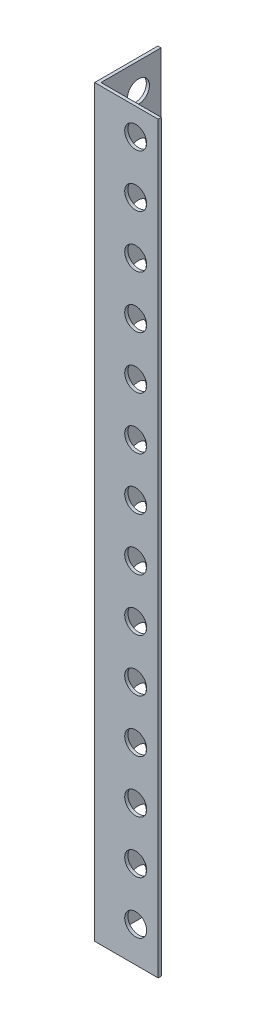
ISO-10303-21;
HEADER;
FILE_DESCRIPTION(('STEP AP214'),'2;1');
FILE_NAME('part.step','',(''),(''),'','','');
FILE_SCHEMA(('AUTOMOTIVE_DESIGN { 1 0 10303 214 1 1 1 1 }'));
ENDSEC;
DATA;
#1=APPLICATION_CONTEXT('core data for automotive mechanical design processes');
#2=APPLICATION_PROTOCOL_DEFINITION('international standard','automotive_design',2000,#1);
#3=PRODUCT_CONTEXT('',#1,'mechanical');
#4=PRODUCT('Part','Part','',(#3));
#5=PRODUCT_RELATED_PRODUCT_CATEGORY('part','',(#4));
#6=PRODUCT_DEFINITION_FORMATION('','',#4);
#7=PRODUCT_DEFINITION_CONTEXT('part definition',#1,'design');
#8=PRODUCT_DEFINITION('design','',#6,#7);
#9=PRODUCT_DEFINITION_SHAPE('','',#8);
#10=(LENGTH_UNIT() NAMED_UNIT(*) SI_UNIT(.MILLI.,.METRE.));
#11=(NAMED_UNIT(*) PLANE_ANGLE_UNIT() SI_UNIT($,.RADIAN.));
#12=(NAMED_UNIT(*) SI_UNIT($,.STERADIAN.) SOLID_ANGLE_UNIT());
#13=UNCERTAINTY_MEASURE_WITH_UNIT(LENGTH_MEASURE(1.E-05),#10,'distance_accuracy_value','');
#14=(GEOMETRIC_REPRESENTATION_CONTEXT(3) GLOBAL_UNCERTAINTY_ASSIGNED_CONTEXT((#13)) GLOBAL_UNIT_ASSIGNED_CONTEXT((#10,
#11,#12)) REPRESENTATION_CONTEXT('',''));
#15=CARTESIAN_POINT('',(0.,0.,0.));
#16=DIRECTION('',(0.,0.,1.));
#17=DIRECTION('',(1.,0.,0.));
#18=AXIS2_PLACEMENT_3D('',#15,#16,#17);
#19=CARTESIAN_POINT('',(0.,363.031,-30.861));
#20=DIRECTION('',(1.,0.,0.));
#21=DIRECTION('',(0.,0.,-1.));
#22=AXIS2_PLACEMENT_3D('',#19,#20,#21);
#23=PLANE('',#22);
#24=CARTESIAN_POINT('',(0.,324.431,-19.861));
#25=DIRECTION('',(-1.,0.,0.));
#26=DIRECTION('',(0.,0.,1.));
#27=AXIS2_PLACEMENT_3D('',#24,#25,#26);
#28=CIRCLE('',#27,5.35);
#29=CARTESIAN_POINT('',(0.,324.431,-14.511));
#30=VERTEX_POINT('',#29);
#31=EDGE_CURVE('E149',#30,#30,#28,.T.);
#32=ORIENTED_EDGE('',*,*,#31,.F.);
#33=EDGE_LOOP('',(#32));
#34=FACE_BOUND('',#33,.T.);
#35=CARTESIAN_POINT('',(0.,298.831,-19.861));
#36=DIRECTION('',(-1.,0.,0.));
#37=DIRECTION('',(0.,0.,1.));
#38=AXIS2_PLACEMENT_3D('',#35,#36,#37);
#39=CIRCLE('',#38,5.35);
#40=CARTESIAN_POINT('',(0.,298.831,-14.511));
#41=VERTEX_POINT('',#40);
#42=EDGE_CURVE('E274',#41,#41,#39,.T.);
#43=ORIENTED_EDGE('',*,*,#42,.F.);
#44=EDGE_LOOP('',(#43));
#45=FACE_BOUND('',#44,.T.);
#46=CARTESIAN_POINT('',(0.,273.231,-19.861));
#47=DIRECTION('',(-1.,0.,0.));
#48=DIRECTION('',(0.,0.,1.));
#49=AXIS2_PLACEMENT_3D('',#46,#47,#48);
#50=CIRCLE('',#49,5.35);
#51=CARTESIAN_POINT('',(0.,273.231,-14.511));
#52=VERTEX_POINT('',#51);
#53=EDGE_CURVE('E278',#52,#52,#50,.T.);
#54=ORIENTED_EDGE('',*,*,#53,.F.);
#55=EDGE_LOOP('',(#54));
#56=FACE_BOUND('',#55,.T.);
#57=CARTESIAN_POINT('',(0.,247.631,-19.861));
#58=DIRECTION('',(-1.,0.,0.));
#59=DIRECTION('',(0.,0.,1.));
#60=AXIS2_PLACEMENT_3D('',#57,#58,#59);
#61=CIRCLE('',#60,5.35);
#62=CARTESIAN_POINT('',(0.,247.631,-14.511));
#63=VERTEX_POINT('',#62);
#64=EDGE_CURVE('E282',#63,#63,#61,.T.);
#65=ORIENTED_EDGE('',*,*,#64,.F.);
#66=EDGE_LOOP('',(#65));
#67=FACE_BOUND('',#66,.T.);
#68=CARTESIAN_POINT('',(0.,222.031,-19.861));
#69=DIRECTION('',(-1.,0.,0.));
#70=DIRECTION('',(0.,0.,1.));
#71=AXIS2_PLACEMENT_3D('',#68,#69,#70);
#72=CIRCLE('',#71,5.35);
#73=CARTESIAN_POINT('',(0.,222.031,-14.511));
#74=VERTEX_POINT('',#73);
#75=EDGE_CURVE('E286',#74,#74,#72,.T.);
#76=ORIENTED_EDGE('',*,*,#75,.F.);
#77=EDGE_LOOP('',(#76));
#78=FACE_BOUND('',#77,.T.);
#79=CARTESIAN_POINT('',(0.,196.431,-19.861));
#80=DIRECTION('',(-1.,0.,0.));
#81=DIRECTION('',(0.,0.,1.));
#82=AXIS2_PLACEMENT_3D('',#79,#80,#81);
#83=CIRCLE('',#82,5.35);
#84=CARTESIAN_POINT('',(0.,196.431,-14.511));
#85=VERTEX_POINT('',#84);
#86=EDGE_CURVE('E290',#85,#85,#83,.T.);
#87=ORIENTED_EDGE('',*,*,#86,.F.);
#88=EDGE_LOOP('',(#87));
#89=FACE_BOUND('',#88,.T.);
#90=CARTESIAN_POINT('',(0.,170.831,-19.861));
#91=DIRECTION('',(-1.,0.,0.));
#92=DIRECTION('',(0.,0.,1.));
#93=AXIS2_PLACEMENT_3D('',#90,#91,#92);
#94=CIRCLE('',#93,5.35);
#95=CARTESIAN_POINT('',(0.,170.831,-14.511));
#96=VERTEX_POINT('',#95);
#97=EDGE_CURVE('E294',#96,#96,#94,.T.);
#98=ORIENTED_EDGE('',*,*,#97,.F.);
#99=EDGE_LOOP('',(#98));
#100=FACE_BOUND('',#99,.T.);
#101=CARTESIAN_POINT('',(0.,145.231,-19.861));
#102=DIRECTION('',(-1.,0.,0.));
#103=DIRECTION('',(0.,0.,1.));
#104=AXIS2_PLACEMENT_3D('',#101,#102,#103);
#105=CIRCLE('',#104,5.35);
#106=CARTESIAN_POINT('',(0.,145.231,-14.511));
#107=VERTEX_POINT('',#106);
#108=EDGE_CURVE('E298',#107,#107,#105,.T.);
#109=ORIENTED_EDGE('',*,*,#108,.F.);
#110=EDGE_LOOP('',(#109));
#111=FACE_BOUND('',#110,.T.);
#112=CARTESIAN_POINT('',(0.,119.631,-19.861));
#113=DIRECTION('',(-1.,0.,0.));
#114=DIRECTION('',(0.,0.,1.));
#115=AXIS2_PLACEMENT_3D('',#112,#113,#114);
#116=CIRCLE('',#115,5.35);
#117=CARTESIAN_POINT('',(0.,119.631,-14.511));
#118=VERTEX_POINT('',#117);
#119=EDGE_CURVE('E302',#118,#118,#116,.T.);
#120=ORIENTED_EDGE('',*,*,#119,.F.);
#121=EDGE_LOOP('',(#120));
#122=FACE_BOUND('',#121,.T.);
#123=CARTESIAN_POINT('',(0.,94.031,-19.861));
#124=DIRECTION('',(-1.,0.,0.));
#125=DIRECTION('',(0.,0.,1.));
#126=AXIS2_PLACEMENT_3D('',#123,#124,#125);
#127=CIRCLE('',#126,5.35);
#128=CARTESIAN_POINT('',(0.,94.031,-14.511));
#129=VERTEX_POINT('',#128);
#130=EDGE_CURVE('E306',#129,#129,#127,.T.);
#131=ORIENTED_EDGE('',*,*,#130,.F.);
#132=EDGE_LOOP('',(#131));
#133=FACE_BOUND('',#132,.T.);
#134=CARTESIAN_POINT('',(0.,68.431,-19.861));
#135=DIRECTION('',(-1.,0.,0.));
#136=DIRECTION('',(0.,0.,1.));
#137=AXIS2_PLACEMENT_3D('',#134,#135,#136);
#138=CIRCLE('',#137,5.35);
#139=CARTESIAN_POINT('',(0.,68.431,-14.511));
#140=VERTEX_POINT('',#139);
#141=EDGE_CURVE('E232',#140,#140,#138,.T.);
#142=ORIENTED_EDGE('',*,*,#141,.F.);
#143=EDGE_LOOP('',(#142));
#144=FACE_BOUND('',#143,.T.);
#145=CARTESIAN_POINT('',(0.,42.831,-19.861));
#146=DIRECTION('',(-1.,0.,0.));
#147=DIRECTION('',(0.,0.,1.));
#148=AXIS2_PLACEMENT_3D('',#145,#146,#147);
#149=CIRCLE('',#148,5.35);
#150=CARTESIAN_POINT('',(0.,42.831,-14.511));
#151=VERTEX_POINT('',#150);
#152=EDGE_CURVE('E227',#151,#151,#149,.T.);
#153=ORIENTED_EDGE('',*,*,#152,.F.);
#154=EDGE_LOOP('',(#153));
#155=FACE_BOUND('',#154,.T.);
#156=CARTESIAN_POINT('',(0.,17.2309999999999,-19.861));
#157=DIRECTION('',(-1.,0.,0.));
#158=DIRECTION('',(0.,0.,1.));
#159=AXIS2_PLACEMENT_3D('',#156,#157,#158);
#160=CIRCLE('',#159,5.35);
#161=CARTESIAN_POINT('',(0.,17.2309999999999,-14.511));
#162=VERTEX_POINT('',#161);
#163=EDGE_CURVE('E223',#162,#162,#160,.T.);
#164=ORIENTED_EDGE('',*,*,#163,.F.);
#165=EDGE_LOOP('',(#164));
#166=FACE_BOUND('',#165,.T.);
#167=CARTESIAN_POINT('',(0.,350.031,-19.861));
#168=DIRECTION('',(-1.,0.,0.));
#169=DIRECTION('',(0.,0.,1.));
#170=AXIS2_PLACEMENT_3D('',#167,#168,#169);
#171=CIRCLE('',#170,5.35);
#172=CARTESIAN_POINT('',(0.,350.031,-14.511));
#173=VERTEX_POINT('',#172);
#174=EDGE_CURVE('E140',#173,#173,#171,.T.);
#175=ORIENTED_EDGE('',*,*,#174,.F.);
#176=EDGE_LOOP('',(#175));
#177=FACE_BOUND('',#176,.T.);
#178=DIRECTION('',(0.,0.,1.));
#179=VECTOR('',#178,1.);
#180=CARTESIAN_POINT('',(0.,0.,-30.861));
#181=LINE('',#180,#179);
#182=CARTESIAN_POINT('',(0.,0.,-30.861));
#183=VERTEX_POINT('',#182);
#184=CARTESIAN_POINT('',(0.,0.,0.));
#185=VERTEX_POINT('',#184);
#186=EDGE_CURVE('E121',#183,#185,#181,.T.);
#187=ORIENTED_EDGE('',*,*,#186,.T.);
#188=DIRECTION('',(0.,-1.,0.));
#189=VECTOR('',#188,1.);
#190=CARTESIAN_POINT('',(0.,363.031,0.));
#191=LINE('',#190,#189);
#192=CARTESIAN_POINT('',(0.,363.031,0.));
#193=VERTEX_POINT('',#192);
#194=EDGE_CURVE('E11',#193,#185,#191,.T.);
#195=ORIENTED_EDGE('',*,*,#194,.F.);
#196=DIRECTION('',(0.,0.,1.));
#197=VECTOR('',#196,1.);
#198=CARTESIAN_POINT('',(0.,363.031,-30.861));
#199=LINE('',#198,#197);
#200=CARTESIAN_POINT('',(0.,363.031,-30.861));
#201=VERTEX_POINT('',#200);
#202=EDGE_CURVE('E132',#201,#193,#199,.T.);
#203=ORIENTED_EDGE('',*,*,#202,.F.);
#204=DIRECTION('',(0.,-1.,0.));
#205=VECTOR('',#204,1.);
#206=CARTESIAN_POINT('',(0.,363.031,-30.861));
#207=LINE('',#206,#205);
#208=EDGE_CURVE('E117',#201,#183,#207,.T.);
#209=ORIENTED_EDGE('',*,*,#208,.T.);
#210=EDGE_LOOP('',(#187,#195,#203,#209));
#211=FACE_BOUND('',#210,.T.);
#212=ADVANCED_FACE('F35',(#34,#45,#56,#67,#78,#89,#100,#111,#122,#133,#144,#155,#166,#177,#211),
#23,.F.);
#213=CARTESIAN_POINT('',(0.,363.031,0.));
#214=DIRECTION('',(0.,0.,-1.));
#215=DIRECTION('',(-1.,0.,0.));
#216=AXIS2_PLACEMENT_3D('',#213,#214,#215);
#217=PLANE('',#216);
#218=CARTESIAN_POINT('',(20.0261,324.431,0.));
#219=DIRECTION('',(0.,0.,1.));
#220=DIRECTION('',(1.,0.,0.));
#221=AXIS2_PLACEMENT_3D('',#218,#219,#220);
#222=CIRCLE('',#221,5.35);
#223=CARTESIAN_POINT('',(25.3761,324.431,0.));
#224=VERTEX_POINT('',#223);
#225=EDGE_CURVE('E189',#224,#224,#222,.T.);
#226=ORIENTED_EDGE('',*,*,#225,.F.);
#227=EDGE_LOOP('',(#226));
#228=FACE_BOUND('',#227,.T.);
#229=CARTESIAN_POINT('',(20.0261,298.831,0.));
#230=DIRECTION('',(0.,0.,1.));
#231=DIRECTION('',(1.,0.,0.));
#232=AXIS2_PLACEMENT_3D('',#229,#230,#231);
#233=CIRCLE('',#232,5.35);
#234=CARTESIAN_POINT('',(25.3761,298.831,0.));
#235=VERTEX_POINT('',#234);
#236=EDGE_CURVE('E436',#235,#235,#233,.T.);
#237=ORIENTED_EDGE('',*,*,#236,.F.);
#238=EDGE_LOOP('',(#237));
#239=FACE_BOUND('',#238,.T.);
#240=CARTESIAN_POINT('',(20.0261,273.231,0.));
#241=DIRECTION('',(0.,0.,1.));
#242=DIRECTION('',(1.,0.,0.));
#243=AXIS2_PLACEMENT_3D('',#240,#241,#242);
#244=CIRCLE('',#243,5.35);
#245=CARTESIAN_POINT('',(25.3761,273.231,0.));
#246=VERTEX_POINT('',#245);
#247=EDGE_CURVE('E439',#246,#246,#244,.T.);
#248=ORIENTED_EDGE('',*,*,#247,.F.);
#249=EDGE_LOOP('',(#248));
#250=FACE_BOUND('',#249,.T.);
#251=CARTESIAN_POINT('',(20.0261,247.631,0.));
#252=DIRECTION('',(0.,0.,1.));
#253=DIRECTION('',(1.,0.,0.));
#254=AXIS2_PLACEMENT_3D('',#251,#252,#253);
#255=CIRCLE('',#254,5.35);
#256=CARTESIAN_POINT('',(25.3761,247.631,0.));
#257=VERTEX_POINT('',#256);
#258=EDGE_CURVE('E444',#257,#257,#255,.T.);
#259=ORIENTED_EDGE('',*,*,#258,.F.);
#260=EDGE_LOOP('',(#259));
#261=FACE_BOUND('',#260,.T.);
#262=CARTESIAN_POINT('',(20.0261,222.031,0.));
#263=DIRECTION('',(0.,0.,1.));
#264=DIRECTION('',(1.,0.,0.));
#265=AXIS2_PLACEMENT_3D('',#262,#263,#264);
#266=CIRCLE('',#265,5.35);
#267=CARTESIAN_POINT('',(25.3761,222.031,0.));
#268=VERTEX_POINT('',#267);
#269=EDGE_CURVE('E447',#268,#268,#266,.T.);
#270=ORIENTED_EDGE('',*,*,#269,.F.);
#271=EDGE_LOOP('',(#270));
#272=FACE_BOUND('',#271,.T.);
#273=CARTESIAN_POINT('',(20.0261,196.431,0.));
#274=DIRECTION('',(0.,0.,1.));
#275=DIRECTION('',(1.,0.,0.));
#276=AXIS2_PLACEMENT_3D('',#273,#274,#275);
#277=CIRCLE('',#276,5.35);
#278=CARTESIAN_POINT('',(25.3761,196.431,0.));
#279=VERTEX_POINT('',#278);
#280=EDGE_CURVE('E450',#279,#279,#277,.T.);
#281=ORIENTED_EDGE('',*,*,#280,.F.);
#282=EDGE_LOOP('',(#281));
#283=FACE_BOUND('',#282,.T.);
#284=CARTESIAN_POINT('',(20.0261,170.831,0.));
#285=DIRECTION('',(0.,0.,1.));
#286=DIRECTION('',(1.,0.,0.));
#287=AXIS2_PLACEMENT_3D('',#284,#285,#286);
#288=CIRCLE('',#287,5.35);
#289=CARTESIAN_POINT('',(25.3761,170.831,0.));
#290=VERTEX_POINT('',#289);
#291=EDGE_CURVE('E453',#290,#290,#288,.T.);
#292=ORIENTED_EDGE('',*,*,#291,.F.);
#293=EDGE_LOOP('',(#292));
#294=FACE_BOUND('',#293,.T.);
#295=CARTESIAN_POINT('',(20.0261,145.231,0.));
#296=DIRECTION('',(0.,0.,1.));
#297=DIRECTION('',(1.,0.,0.));
#298=AXIS2_PLACEMENT_3D('',#295,#296,#297);
#299=CIRCLE('',#298,5.35);
#300=CARTESIAN_POINT('',(25.3761,145.231,0.));
#301=VERTEX_POINT('',#300);
#302=EDGE_CURVE('E456',#301,#301,#299,.T.);
#303=ORIENTED_EDGE('',*,*,#302,.F.);
#304=EDGE_LOOP('',(#303));
#305=FACE_BOUND('',#304,.T.);
#306=CARTESIAN_POINT('',(20.0261,119.631,0.));
#307=DIRECTION('',(0.,0.,1.));
#308=DIRECTION('',(1.,0.,0.));
#309=AXIS2_PLACEMENT_3D('',#306,#307,#308);
#310=CIRCLE('',#309,5.35);
#311=CARTESIAN_POINT('',(25.3761,119.631,0.));
#312=VERTEX_POINT('',#311);
#313=EDGE_CURVE('E459',#312,#312,#310,.T.);
#314=ORIENTED_EDGE('',*,*,#313,.F.);
#315=EDGE_LOOP('',(#314));
#316=FACE_BOUND('',#315,.T.);
#317=CARTESIAN_POINT('',(20.0261,94.031,0.));
#318=DIRECTION('',(0.,0.,1.));
#319=DIRECTION('',(1.,0.,0.));
#320=AXIS2_PLACEMENT_3D('',#317,#318,#319);
#321=CIRCLE('',#320,5.35);
#322=CARTESIAN_POINT('',(25.3761,94.031,0.));
#323=VERTEX_POINT('',#322);
#324=EDGE_CURVE('E462',#323,#323,#321,.T.);
#325=ORIENTED_EDGE('',*,*,#324,.F.);
#326=EDGE_LOOP('',(#325));
#327=FACE_BOUND('',#326,.T.);
#328=CARTESIAN_POINT('',(20.0261,68.431,0.));
#329=DIRECTION('',(0.,0.,1.));
#330=DIRECTION('',(1.,0.,0.));
#331=AXIS2_PLACEMENT_3D('',#328,#329,#330);
#332=CIRCLE('',#331,5.35);
#333=CARTESIAN_POINT('',(25.3761,68.431,0.));
#334=VERTEX_POINT('',#333);
#335=EDGE_CURVE('E465',#334,#334,#332,.T.);
#336=ORIENTED_EDGE('',*,*,#335,.F.);
#337=EDGE_LOOP('',(#336));
#338=FACE_BOUND('',#337,.T.);
#339=CARTESIAN_POINT('',(20.0261,42.831,0.));
#340=DIRECTION('',(0.,0.,1.));
#341=DIRECTION('',(1.,0.,0.));
#342=AXIS2_PLACEMENT_3D('',#339,#340,#341);
#343=CIRCLE('',#342,5.35);
#344=CARTESIAN_POINT('',(25.3761,42.831,0.));
#345=VERTEX_POINT('',#344);
#346=EDGE_CURVE('E468',#345,#345,#343,.T.);
#347=ORIENTED_EDGE('',*,*,#346,.F.);
#348=EDGE_LOOP('',(#347));
#349=FACE_BOUND('',#348,.T.);
#350=CARTESIAN_POINT('',(20.0261,17.2309999999999,0.));
#351=DIRECTION('',(0.,0.,1.));
#352=DIRECTION('',(1.,0.,0.));
#353=AXIS2_PLACEMENT_3D('',#350,#351,#352);
#354=CIRCLE('',#353,5.35);
#355=CARTESIAN_POINT('',(25.3761,17.2309999999999,0.));
#356=VERTEX_POINT('',#355);
#357=EDGE_CURVE('E471',#356,#356,#354,.T.);
#358=ORIENTED_EDGE('',*,*,#357,.F.);
#359=EDGE_LOOP('',(#358));
#360=FACE_BOUND('',#359,.T.);
#361=CARTESIAN_POINT('',(20.0261,350.031,0.));
#362=DIRECTION('',(0.,0.,1.));
#363=DIRECTION('',(1.,0.,0.));
#364=AXIS2_PLACEMENT_3D('',#361,#362,#363);
#365=CIRCLE('',#364,5.35);
#366=CARTESIAN_POINT('',(25.3761,350.031,0.));
#367=VERTEX_POINT('',#366);
#368=EDGE_CURVE('E144',#367,#367,#365,.T.);
#369=ORIENTED_EDGE('',*,*,#368,.F.);
#370=EDGE_LOOP('',(#369));
#371=FACE_BOUND('',#370,.T.);
#372=DIRECTION('',(1.,0.,0.));
#373=VECTOR('',#372,1.);
#374=CARTESIAN_POINT('',(0.,0.,0.));
#375=LINE('',#374,#373);
#376=CARTESIAN_POINT('',(31.0261,0.,0.));
#377=VERTEX_POINT('',#376);
#378=EDGE_CURVE('E124',#185,#377,#375,.T.);
#379=ORIENTED_EDGE('',*,*,#378,.T.);
#380=DIRECTION('',(0.,-1.,0.));
#381=VECTOR('',#380,1.);
#382=CARTESIAN_POINT('',(31.0261,363.031,0.));
#383=LINE('',#382,#381);
#384=CARTESIAN_POINT('',(31.0261,363.031,0.));
#385=VERTEX_POINT('',#384);
#386=EDGE_CURVE('E44',#385,#377,#383,.T.);
#387=ORIENTED_EDGE('',*,*,#386,.F.);
#388=DIRECTION('',(1.,0.,0.));
#389=VECTOR('',#388,1.);
#390=CARTESIAN_POINT('',(0.,363.031,0.));
#391=LINE('',#390,#389);
#392=EDGE_CURVE('E90',#193,#385,#391,.T.);
#393=ORIENTED_EDGE('',*,*,#392,.F.);
#394=ORIENTED_EDGE('',*,*,#194,.T.);
#395=EDGE_LOOP('',(#379,#387,#393,#394));
#396=FACE_BOUND('',#395,.T.);
#397=ADVANCED_FACE('F243',(#228,#239,#250,#261,#272,#283,#294,#305,#316,#327,#338,#349,#360,
#371,#396),#217,.F.);
#398=CARTESIAN_POINT('',(31.0261,363.031,0.));
#399=DIRECTION('',(-1.,0.,0.));
#400=DIRECTION('',(0.,0.,1.));
#401=AXIS2_PLACEMENT_3D('',#398,#399,#400);
#402=PLANE('',#401);
#403=DIRECTION('',(0.,0.,-1.));
#404=VECTOR('',#403,1.);
#405=CARTESIAN_POINT('',(31.0261,0.,0.));
#406=LINE('',#405,#404);
#407=CARTESIAN_POINT('',(31.0261,0.,-1.54));
#408=VERTEX_POINT('',#407);
#409=EDGE_CURVE('E127',#377,#408,#406,.T.);
#410=ORIENTED_EDGE('',*,*,#409,.T.);
#411=DIRECTION('',(0.,-1.,0.));
#412=VECTOR('',#411,1.);
#413=CARTESIAN_POINT('',(31.0261,363.031,-1.54));
#414=LINE('',#413,#412);
#415=CARTESIAN_POINT('',(31.0261,363.031,-1.54));
#416=VERTEX_POINT('',#415);
#417=EDGE_CURVE('E112',#416,#408,#414,.T.);
#418=ORIENTED_EDGE('',*,*,#417,.F.);
#419=DIRECTION('',(0.,0.,-1.));
#420=VECTOR('',#419,1.);
#421=CARTESIAN_POINT('',(31.0261,363.031,0.));
#422=LINE('',#421,#420);
#423=EDGE_CURVE('E103',#385,#416,#422,.T.);
#424=ORIENTED_EDGE('',*,*,#423,.F.);
#425=ORIENTED_EDGE('',*,*,#386,.T.);
#426=EDGE_LOOP('',(#410,#418,#424,#425));
#427=FACE_BOUND('',#426,.T.);
#428=ADVANCED_FACE('F246',(#427),#402,.F.);
#429=CARTESIAN_POINT('',(31.0261,363.031,-1.54));
#430=DIRECTION('',(0.,0.,1.));
#431=DIRECTION('',(1.,0.,0.));
#432=AXIS2_PLACEMENT_3D('',#429,#430,#431);
#433=PLANE('',#432);
#434=CARTESIAN_POINT('',(20.0261,324.431,-1.54));
#435=DIRECTION('',(0.,0.,1.));
#436=DIRECTION('',(1.,0.,0.));
#437=AXIS2_PLACEMENT_3D('',#434,#435,#436);
#438=CIRCLE('',#437,5.35);
#439=CARTESIAN_POINT('',(25.3761,324.431,-1.54));
#440=VERTEX_POINT('',#439);
#441=EDGE_CURVE('E38',#440,#440,#438,.T.);
#442=ORIENTED_EDGE('',*,*,#441,.T.);
#443=EDGE_LOOP('',(#442));
#444=FACE_BOUND('',#443,.T.);
#445=CARTESIAN_POINT('',(20.0261,298.831,-1.54));
#446=DIRECTION('',(0.,0.,1.));
#447=DIRECTION('',(1.,0.,0.));
#448=AXIS2_PLACEMENT_3D('',#445,#446,#447);
#449=CIRCLE('',#448,5.35);
#450=CARTESIAN_POINT('',(25.3761,298.831,-1.54));
#451=VERTEX_POINT('',#450);
#452=EDGE_CURVE('E218',#451,#451,#449,.T.);
#453=ORIENTED_EDGE('',*,*,#452,.T.);
#454=EDGE_LOOP('',(#453));
#455=FACE_BOUND('',#454,.T.);
#456=CARTESIAN_POINT('',(20.0261,273.231,-1.54));
#457=DIRECTION('',(0.,0.,1.));
#458=DIRECTION('',(1.,0.,0.));
#459=AXIS2_PLACEMENT_3D('',#456,#457,#458);
#460=CIRCLE('',#459,5.35);
#461=CARTESIAN_POINT('',(25.3761,273.231,-1.54));
#462=VERTEX_POINT('',#461);
#463=EDGE_CURVE('E216',#462,#462,#460,.T.);
#464=ORIENTED_EDGE('',*,*,#463,.T.);
#465=EDGE_LOOP('',(#464));
#466=FACE_BOUND('',#465,.T.);
#467=CARTESIAN_POINT('',(20.0261,247.631,-1.54));
#468=DIRECTION('',(0.,0.,1.));
#469=DIRECTION('',(1.,0.,0.));
#470=AXIS2_PLACEMENT_3D('',#467,#468,#469);
#471=CIRCLE('',#470,5.35);
#472=CARTESIAN_POINT('',(25.3761,247.631,-1.54));
#473=VERTEX_POINT('',#472);
#474=EDGE_CURVE('E213',#473,#473,#471,.T.);
#475=ORIENTED_EDGE('',*,*,#474,.T.);
#476=EDGE_LOOP('',(#475));
#477=FACE_BOUND('',#476,.T.);
#478=CARTESIAN_POINT('',(20.0261,222.031,-1.54));
#479=DIRECTION('',(0.,0.,1.));
#480=DIRECTION('',(1.,0.,0.));
#481=AXIS2_PLACEMENT_3D('',#478,#479,#480);
#482=CIRCLE('',#481,5.35);
#483=CARTESIAN_POINT('',(25.3761,222.031,-1.54));
#484=VERTEX_POINT('',#483);
#485=EDGE_CURVE('E210',#484,#484,#482,.T.);
#486=ORIENTED_EDGE('',*,*,#485,.T.);
#487=EDGE_LOOP('',(#486));
#488=FACE_BOUND('',#487,.T.);
#489=CARTESIAN_POINT('',(20.0261,196.431,-1.54));
#490=DIRECTION('',(0.,0.,1.));
#491=DIRECTION('',(1.,0.,0.));
#492=AXIS2_PLACEMENT_3D('',#489,#490,#491);
#493=CIRCLE('',#492,5.35);
#494=CARTESIAN_POINT('',(25.3761,196.431,-1.54));
#495=VERTEX_POINT('',#494);
#496=EDGE_CURVE('E207',#495,#495,#493,.T.);
#497=ORIENTED_EDGE('',*,*,#496,.T.);
#498=EDGE_LOOP('',(#497));
#499=FACE_BOUND('',#498,.T.);
#500=CARTESIAN_POINT('',(20.0261,170.831,-1.54));
#501=DIRECTION('',(0.,0.,1.));
#502=DIRECTION('',(1.,0.,0.));
#503=AXIS2_PLACEMENT_3D('',#500,#501,#502);
#504=CIRCLE('',#503,5.35);
#505=CARTESIAN_POINT('',(25.3761,170.831,-1.54));
#506=VERTEX_POINT('',#505);
#507=EDGE_CURVE('E204',#506,#506,#504,.T.);
#508=ORIENTED_EDGE('',*,*,#507,.T.);
#509=EDGE_LOOP('',(#508));
#510=FACE_BOUND('',#509,.T.);
#511=CARTESIAN_POINT('',(20.0261,145.231,-1.54));
#512=DIRECTION('',(0.,0.,1.));
#513=DIRECTION('',(1.,0.,0.));
#514=AXIS2_PLACEMENT_3D('',#511,#512,#513);
#515=CIRCLE('',#514,5.35);
#516=CARTESIAN_POINT('',(25.3761,145.231,-1.54));
#517=VERTEX_POINT('',#516);
#518=EDGE_CURVE('E201',#517,#517,#515,.T.);
#519=ORIENTED_EDGE('',*,*,#518,.T.);
#520=EDGE_LOOP('',(#519));
#521=FACE_BOUND('',#520,.T.);
#522=CARTESIAN_POINT('',(20.0261,119.631,-1.54));
#523=DIRECTION('',(0.,0.,1.));
#524=DIRECTION('',(1.,0.,0.));
#525=AXIS2_PLACEMENT_3D('',#522,#523,#524);
#526=CIRCLE('',#525,5.35);
#527=CARTESIAN_POINT('',(25.3761,119.631,-1.54));
#528=VERTEX_POINT('',#527);
#529=EDGE_CURVE('E198',#528,#528,#526,.T.);
#530=ORIENTED_EDGE('',*,*,#529,.T.);
#531=EDGE_LOOP('',(#530));
#532=FACE_BOUND('',#531,.T.);
#533=CARTESIAN_POINT('',(20.0261,94.031,-1.54));
#534=DIRECTION('',(0.,0.,1.));
#535=DIRECTION('',(1.,0.,0.));
#536=AXIS2_PLACEMENT_3D('',#533,#534,#535);
#537=CIRCLE('',#536,5.35);
#538=CARTESIAN_POINT('',(25.3761,94.031,-1.54));
#539=VERTEX_POINT('',#538);
#540=EDGE_CURVE('E195',#539,#539,#537,.T.);
#541=ORIENTED_EDGE('',*,*,#540,.T.);
#542=EDGE_LOOP('',(#541));
#543=FACE_BOUND('',#542,.T.);
#544=CARTESIAN_POINT('',(20.0261,68.431,-1.54));
#545=DIRECTION('',(0.,0.,1.));
#546=DIRECTION('',(1.,0.,0.));
#547=AXIS2_PLACEMENT_3D('',#544,#545,#546);
#548=CIRCLE('',#547,5.35);
#549=CARTESIAN_POINT('',(25.3761,68.431,-1.54));
#550=VERTEX_POINT('',#549);
#551=EDGE_CURVE('E192',#550,#550,#548,.T.);
#552=ORIENTED_EDGE('',*,*,#551,.T.);
#553=EDGE_LOOP('',(#552));
#554=FACE_BOUND('',#553,.T.);
#555=CARTESIAN_POINT('',(20.0261,42.831,-1.54));
#556=DIRECTION('',(0.,0.,1.));
#557=DIRECTION('',(1.,0.,0.));
#558=AXIS2_PLACEMENT_3D('',#555,#556,#557);
#559=CIRCLE('',#558,5.35);
#560=CARTESIAN_POINT('',(25.3761,42.831,-1.54));
#561=VERTEX_POINT('',#560);
#562=EDGE_CURVE('E188',#561,#561,#559,.T.);
#563=ORIENTED_EDGE('',*,*,#562,.T.);
#564=EDGE_LOOP('',(#563));
#565=FACE_BOUND('',#564,.T.);
#566=CARTESIAN_POINT('',(20.0261,17.2309999999999,-1.54));
#567=DIRECTION('',(0.,0.,1.));
#568=DIRECTION('',(1.,0.,0.));
#569=AXIS2_PLACEMENT_3D('',#566,#567,#568);
#570=CIRCLE('',#569,5.35);
#571=CARTESIAN_POINT('',(25.3761,17.2309999999999,-1.54));
#572=VERTEX_POINT('',#571);
#573=EDGE_CURVE('E185',#572,#572,#570,.T.);
#574=ORIENTED_EDGE('',*,*,#573,.T.);
#575=EDGE_LOOP('',(#574));
#576=FACE_BOUND('',#575,.T.);
#577=CARTESIAN_POINT('',(20.0261,350.031,-1.54));
#578=DIRECTION('',(0.,0.,1.));
#579=DIRECTION('',(1.,0.,0.));
#580=AXIS2_PLACEMENT_3D('',#577,#578,#579);
#581=CIRCLE('',#580,5.35);
#582=CARTESIAN_POINT('',(25.3761,350.031,-1.54));
#583=VERTEX_POINT('',#582);
#584=EDGE_CURVE('E141',#583,#583,#581,.T.);
#585=ORIENTED_EDGE('',*,*,#584,.T.);
#586=EDGE_LOOP('',(#585));
#587=FACE_BOUND('',#586,.T.);
#588=DIRECTION('',(-1.,0.,0.));
#589=VECTOR('',#588,1.);
#590=CARTESIAN_POINT('',(31.0261,0.,-1.54));
#591=LINE('',#590,#589);
#592=CARTESIAN_POINT('',(1.54,0.,-1.54));
#593=VERTEX_POINT('',#592);
#594=EDGE_CURVE('E111',#408,#593,#591,.T.);
#595=ORIENTED_EDGE('',*,*,#594,.T.);
#596=DIRECTION('',(0.,-1.,0.));
#597=VECTOR('',#596,1.);
#598=CARTESIAN_POINT('',(1.54,363.031,-1.54));
#599=LINE('',#598,#597);
#600=CARTESIAN_POINT('',(1.54,363.031,-1.54));
#601=VERTEX_POINT('',#600);
#602=EDGE_CURVE('E108',#601,#593,#599,.T.);
#603=ORIENTED_EDGE('',*,*,#602,.F.);
#604=DIRECTION('',(-1.,0.,0.));
#605=VECTOR('',#604,1.);
#606=CARTESIAN_POINT('',(31.0261,363.031,-1.54));
#607=LINE('',#606,#605);
#608=EDGE_CURVE('E97',#416,#601,#607,.T.);
#609=ORIENTED_EDGE('',*,*,#608,.F.);
#610=ORIENTED_EDGE('',*,*,#417,.T.);
#611=EDGE_LOOP('',(#595,#603,#609,#610));
#612=FACE_BOUND('',#611,.T.);
#613=ADVANCED_FACE('F109',(#444,#455,#466,#477,#488,#499,#510,#521,#532,#543,#554,#565,#576,
#587,#612),#433,.F.);
#614=CARTESIAN_POINT('',(1.54,363.031,-1.54));
#615=DIRECTION('',(-1.,0.,0.));
#616=DIRECTION('',(0.,0.,1.));
#617=AXIS2_PLACEMENT_3D('',#614,#615,#616);
#618=PLANE('',#617);
#619=CARTESIAN_POINT('',(1.54,324.431,-19.861));
#620=DIRECTION('',(-1.,0.,0.));
#621=DIRECTION('',(0.,0.,1.));
#622=AXIS2_PLACEMENT_3D('',#619,#620,#621);
#623=CIRCLE('',#622,5.35);
#624=CARTESIAN_POINT('',(1.54,324.431,-14.511));
#625=VERTEX_POINT('',#624);
#626=EDGE_CURVE('E182',#625,#625,#623,.T.);
#627=ORIENTED_EDGE('',*,*,#626,.T.);
#628=EDGE_LOOP('',(#627));
#629=FACE_BOUND('',#628,.T.);
#630=CARTESIAN_POINT('',(1.54,298.831,-19.861));
#631=DIRECTION('',(-1.,0.,0.));
#632=DIRECTION('',(0.,0.,1.));
#633=AXIS2_PLACEMENT_3D('',#630,#631,#632);
#634=CIRCLE('',#633,5.35);
#635=CARTESIAN_POINT('',(1.54,298.831,-14.511));
#636=VERTEX_POINT('',#635);
#637=EDGE_CURVE('E179',#636,#636,#634,.T.);
#638=ORIENTED_EDGE('',*,*,#637,.T.);
#639=EDGE_LOOP('',(#638));
#640=FACE_BOUND('',#639,.T.);
#641=CARTESIAN_POINT('',(1.54,273.231,-19.861));
#642=DIRECTION('',(-1.,0.,0.));
#643=DIRECTION('',(0.,0.,1.));
#644=AXIS2_PLACEMENT_3D('',#641,#642,#643);
#645=CIRCLE('',#644,5.35);
#646=CARTESIAN_POINT('',(1.54,273.231,-14.511));
#647=VERTEX_POINT('',#646);
#648=EDGE_CURVE('E176',#647,#647,#645,.T.);
#649=ORIENTED_EDGE('',*,*,#648,.T.);
#650=EDGE_LOOP('',(#649));
#651=FACE_BOUND('',#650,.T.);
#652=CARTESIAN_POINT('',(1.54,247.631,-19.861));
#653=DIRECTION('',(-1.,0.,0.));
#654=DIRECTION('',(0.,0.,1.));
#655=AXIS2_PLACEMENT_3D('',#652,#653,#654);
#656=CIRCLE('',#655,5.35);
#657=CARTESIAN_POINT('',(1.54,247.631,-14.511));
#658=VERTEX_POINT('',#657);
#659=EDGE_CURVE('E173',#658,#658,#656,.T.);
#660=ORIENTED_EDGE('',*,*,#659,.T.);
#661=EDGE_LOOP('',(#660));
#662=FACE_BOUND('',#661,.T.);
#663=CARTESIAN_POINT('',(1.54,222.031,-19.861));
#664=DIRECTION('',(-1.,0.,0.));
#665=DIRECTION('',(0.,0.,1.));
#666=AXIS2_PLACEMENT_3D('',#663,#664,#665);
#667=CIRCLE('',#666,5.35);
#668=CARTESIAN_POINT('',(1.54,222.031,-14.511));
#669=VERTEX_POINT('',#668);
#670=EDGE_CURVE('E170',#669,#669,#667,.T.);
#671=ORIENTED_EDGE('',*,*,#670,.T.);
#672=EDGE_LOOP('',(#671));
#673=FACE_BOUND('',#672,.T.);
#674=CARTESIAN_POINT('',(1.54,196.431,-19.861));
#675=DIRECTION('',(-1.,0.,0.));
#676=DIRECTION('',(0.,0.,1.));
#677=AXIS2_PLACEMENT_3D('',#674,#675,#676);
#678=CIRCLE('',#677,5.35);
#679=CARTESIAN_POINT('',(1.54,196.431,-14.511));
#680=VERTEX_POINT('',#679);
#681=EDGE_CURVE('E167',#680,#680,#678,.T.);
#682=ORIENTED_EDGE('',*,*,#681,.T.);
#683=EDGE_LOOP('',(#682));
#684=FACE_BOUND('',#683,.T.);
#685=CARTESIAN_POINT('',(1.54,170.831,-19.861));
#686=DIRECTION('',(-1.,0.,0.));
#687=DIRECTION('',(0.,0.,1.));
#688=AXIS2_PLACEMENT_3D('',#685,#686,#687);
#689=CIRCLE('',#688,5.35);
#690=CARTESIAN_POINT('',(1.54,170.831,-14.511));
#691=VERTEX_POINT('',#690);
#692=EDGE_CURVE('E164',#691,#691,#689,.T.);
#693=ORIENTED_EDGE('',*,*,#692,.T.);
#694=EDGE_LOOP('',(#693));
#695=FACE_BOUND('',#694,.T.);
#696=CARTESIAN_POINT('',(1.54,145.231,-19.861));
#697=DIRECTION('',(-1.,0.,0.));
#698=DIRECTION('',(0.,0.,1.));
#699=AXIS2_PLACEMENT_3D('',#696,#697,#698);
#700=CIRCLE('',#699,5.35);
#701=CARTESIAN_POINT('',(1.54,145.231,-14.511));
#702=VERTEX_POINT('',#701);
#703=EDGE_CURVE('E161',#702,#702,#700,.T.);
#704=ORIENTED_EDGE('',*,*,#703,.T.);
#705=EDGE_LOOP('',(#704));
#706=FACE_BOUND('',#705,.T.);
#707=CARTESIAN_POINT('',(1.54,119.631,-19.861));
#708=DIRECTION('',(-1.,0.,0.));
#709=DIRECTION('',(0.,0.,1.));
#710=AXIS2_PLACEMENT_3D('',#707,#708,#709);
#711=CIRCLE('',#710,5.35);
#712=CARTESIAN_POINT('',(1.54,119.631,-14.511));
#713=VERTEX_POINT('',#712);
#714=EDGE_CURVE('E158',#713,#713,#711,.T.);
#715=ORIENTED_EDGE('',*,*,#714,.T.);
#716=EDGE_LOOP('',(#715));
#717=FACE_BOUND('',#716,.T.);
#718=CARTESIAN_POINT('',(1.54,94.031,-19.861));
#719=DIRECTION('',(-1.,0.,0.));
#720=DIRECTION('',(0.,0.,1.));
#721=AXIS2_PLACEMENT_3D('',#718,#719,#720);
#722=CIRCLE('',#721,5.35);
#723=CARTESIAN_POINT('',(1.54,94.031,-14.511));
#724=VERTEX_POINT('',#723);
#725=EDGE_CURVE('E155',#724,#724,#722,.T.);
#726=ORIENTED_EDGE('',*,*,#725,.T.);
#727=EDGE_LOOP('',(#726));
#728=FACE_BOUND('',#727,.T.);
#729=CARTESIAN_POINT('',(1.54,68.431,-19.861));
#730=DIRECTION('',(-1.,0.,0.));
#731=DIRECTION('',(0.,0.,1.));
#732=AXIS2_PLACEMENT_3D('',#729,#730,#731);
#733=CIRCLE('',#732,5.35);
#734=CARTESIAN_POINT('',(1.54,68.431,-14.511));
#735=VERTEX_POINT('',#734);
#736=EDGE_CURVE('E152',#735,#735,#733,.T.);
#737=ORIENTED_EDGE('',*,*,#736,.T.);
#738=EDGE_LOOP('',(#737));
#739=FACE_BOUND('',#738,.T.);
#740=CARTESIAN_POINT('',(1.54,42.831,-19.861));
#741=DIRECTION('',(-1.,0.,0.));
#742=DIRECTION('',(0.,0.,1.));
#743=AXIS2_PLACEMENT_3D('',#740,#741,#742);
#744=CIRCLE('',#743,5.35);
#745=CARTESIAN_POINT('',(1.54,42.831,-14.511));
#746=VERTEX_POINT('',#745);
#747=EDGE_CURVE('E148',#746,#746,#744,.T.);
#748=ORIENTED_EDGE('',*,*,#747,.T.);
#749=EDGE_LOOP('',(#748));
#750=FACE_BOUND('',#749,.T.);
#751=CARTESIAN_POINT('',(1.54,17.2309999999999,-19.861));
#752=DIRECTION('',(-1.,0.,0.));
#753=DIRECTION('',(0.,0.,1.));
#754=AXIS2_PLACEMENT_3D('',#751,#752,#753);
#755=CIRCLE('',#754,5.35);
#756=CARTESIAN_POINT('',(1.54,17.2309999999999,-14.511));
#757=VERTEX_POINT('',#756);
#758=EDGE_CURVE('E145',#757,#757,#755,.T.);
#759=ORIENTED_EDGE('',*,*,#758,.T.);
#760=EDGE_LOOP('',(#759));
#761=FACE_BOUND('',#760,.T.);
#762=CARTESIAN_POINT('',(1.54,350.031,-19.861));
#763=DIRECTION('',(-1.,0.,0.));
#764=DIRECTION('',(0.,0.,1.));
#765=AXIS2_PLACEMENT_3D('',#762,#763,#764);
#766=CIRCLE('',#765,5.35);
#767=CARTESIAN_POINT('',(1.54,350.031,-14.511));
#768=VERTEX_POINT('',#767);
#769=EDGE_CURVE('E125',#768,#768,#766,.T.);
#770=ORIENTED_EDGE('',*,*,#769,.T.);
#771=EDGE_LOOP('',(#770));
#772=FACE_BOUND('',#771,.T.);
#773=DIRECTION('',(0.,0.,-1.));
#774=VECTOR('',#773,1.);
#775=CARTESIAN_POINT('',(1.54,0.,-1.54));
#776=LINE('',#775,#774);
#777=CARTESIAN_POINT('',(1.54,0.,-30.861));
#778=VERTEX_POINT('',#777);
#779=EDGE_CURVE('E76',#593,#778,#776,.T.);
#780=ORIENTED_EDGE('',*,*,#779,.T.);
#781=DIRECTION('',(0.,-1.,0.));
#782=VECTOR('',#781,1.);
#783=CARTESIAN_POINT('',(1.54,363.031,-30.861));
#784=LINE('',#783,#782);
#785=CARTESIAN_POINT('',(1.54,363.031,-30.861));
#786=VERTEX_POINT('',#785);
#787=EDGE_CURVE('E113',#786,#778,#784,.T.);
#788=ORIENTED_EDGE('',*,*,#787,.F.);
#789=DIRECTION('',(0.,0.,-1.));
#790=VECTOR('',#789,1.);
#791=CARTESIAN_POINT('',(1.54,363.031,-1.54));
#792=LINE('',#791,#790);
#793=EDGE_CURVE('E101',#601,#786,#792,.T.);
#794=ORIENTED_EDGE('',*,*,#793,.F.);
#795=ORIENTED_EDGE('',*,*,#602,.T.);
#796=EDGE_LOOP('',(#780,#788,#794,#795));
#797=FACE_BOUND('',#796,.T.);
#798=ADVANCED_FACE('F115',(#629,#640,#651,#662,#673,#684,#695,#706,#717,#728,#739,#750,#761,
#772,#797),#618,.F.);
#799=CARTESIAN_POINT('',(1.54,363.031,-30.861));
#800=DIRECTION('',(0.,0.,1.));
#801=DIRECTION('',(1.,0.,0.));
#802=AXIS2_PLACEMENT_3D('',#799,#800,#801);
#803=PLANE('',#802);
#804=DIRECTION('',(-1.,0.,0.));
#805=VECTOR('',#804,1.);
#806=CARTESIAN_POINT('',(1.54,0.,-30.861));
#807=LINE('',#806,#805);
#808=EDGE_CURVE('E82',#778,#183,#807,.T.);
#809=ORIENTED_EDGE('',*,*,#808,.T.);
#810=ORIENTED_EDGE('',*,*,#208,.F.);
#811=DIRECTION('',(-1.,0.,0.));
#812=VECTOR('',#811,1.);
#813=CARTESIAN_POINT('',(1.54,363.031,-30.861));
#814=LINE('',#813,#812);
#815=EDGE_CURVE('E53',#786,#201,#814,.T.);
#816=ORIENTED_EDGE('',*,*,#815,.F.);
#817=ORIENTED_EDGE('',*,*,#787,.T.);
#818=EDGE_LOOP('',(#809,#810,#816,#817));
#819=FACE_BOUND('',#818,.T.);
#820=ADVANCED_FACE('F251',(#819),#803,.F.);
#821=CARTESIAN_POINT('',(0.,363.031,0.));
#822=DIRECTION('',(0.,1.,0.));
#823=DIRECTION('',(0.,0.,1.));
#824=AXIS2_PLACEMENT_3D('',#821,#822,#823);
#825=PLANE('',#824);
#826=ORIENTED_EDGE('',*,*,#202,.T.);
#827=ORIENTED_EDGE('',*,*,#392,.T.);
#828=ORIENTED_EDGE('',*,*,#423,.T.);
#829=ORIENTED_EDGE('',*,*,#608,.T.);
#830=ORIENTED_EDGE('',*,*,#793,.T.);
#831=ORIENTED_EDGE('',*,*,#815,.T.);
#832=EDGE_LOOP('',(#826,#827,#828,#829,#830,#831));
#833=FACE_BOUND('',#832,.T.);
#834=ADVANCED_FACE('F99',(#833),#825,.T.);
#835=CARTESIAN_POINT('',(0.,0.,0.));
#836=DIRECTION('',(0.,1.,0.));
#837=DIRECTION('',(0.,0.,1.));
#838=AXIS2_PLACEMENT_3D('',#835,#836,#837);
#839=PLANE('',#838);
#840=ORIENTED_EDGE('',*,*,#186,.F.);
#841=ORIENTED_EDGE('',*,*,#808,.F.);
#842=ORIENTED_EDGE('',*,*,#779,.F.);
#843=ORIENTED_EDGE('',*,*,#594,.F.);
#844=ORIENTED_EDGE('',*,*,#409,.F.);
#845=ORIENTED_EDGE('',*,*,#378,.F.);
#846=EDGE_LOOP('',(#840,#841,#842,#843,#844,#845));
#847=FACE_BOUND('',#846,.T.);
#848=ADVANCED_FACE('F249',(#847),#839,.F.);
#849=CARTESIAN_POINT('',(31.0261,350.031,-19.861));
#850=DIRECTION('',(-1.,0.,0.));
#851=DIRECTION('',(0.,0.,1.));
#852=AXIS2_PLACEMENT_3D('',#849,#850,#851);
#853=CYLINDRICAL_SURFACE('',#852,5.35);
#854=ORIENTED_EDGE('',*,*,#174,.T.);
#855=EDGE_LOOP('',(#854));
#856=FACE_BOUND('',#855,.T.);
#857=ORIENTED_EDGE('',*,*,#769,.F.);
#858=EDGE_LOOP('',(#857));
#859=FACE_BOUND('',#858,.T.);
#860=ADVANCED_FACE('F315',(#856,#859),#853,.F.);
#861=CARTESIAN_POINT('',(20.0261,350.031,-30.861));
#862=DIRECTION('',(0.,0.,1.));
#863=DIRECTION('',(1.,0.,0.));
#864=AXIS2_PLACEMENT_3D('',#861,#862,#863);
#865=CYLINDRICAL_SURFACE('',#864,5.35);
#866=ORIENTED_EDGE('',*,*,#368,.T.);
#867=EDGE_LOOP('',(#866));
#868=FACE_BOUND('',#867,.T.);
#869=ORIENTED_EDGE('',*,*,#584,.F.);
#870=EDGE_LOOP('',(#869));
#871=FACE_BOUND('',#870,.T.);
#872=ADVANCED_FACE('F318',(#868,#871),#865,.F.);
#873=CARTESIAN_POINT('',(31.0261,17.2309999999999,-19.861));
#874=DIRECTION('',(-1.,0.,0.));
#875=DIRECTION('',(0.,0.,1.));
#876=AXIS2_PLACEMENT_3D('',#873,#874,#875);
#877=CYLINDRICAL_SURFACE('',#876,5.35);
#878=ORIENTED_EDGE('',*,*,#163,.T.);
#879=EDGE_LOOP('',(#878));
#880=FACE_BOUND('',#879,.T.);
#881=ORIENTED_EDGE('',*,*,#758,.F.);
#882=EDGE_LOOP('',(#881));
#883=FACE_BOUND('',#882,.T.);
#884=ADVANCED_FACE('F326',(#880,#883),#877,.F.);
#885=CARTESIAN_POINT('',(31.0261,42.831,-19.861));
#886=DIRECTION('',(-1.,0.,0.));
#887=DIRECTION('',(0.,0.,1.));
#888=AXIS2_PLACEMENT_3D('',#885,#886,#887);
#889=CYLINDRICAL_SURFACE('',#888,5.35);
#890=ORIENTED_EDGE('',*,*,#152,.T.);
#891=EDGE_LOOP('',(#890));
#892=FACE_BOUND('',#891,.T.);
#893=ORIENTED_EDGE('',*,*,#747,.F.);
#894=EDGE_LOOP('',(#893));
#895=FACE_BOUND('',#894,.T.);
#896=ADVANCED_FACE('F332',(#892,#895),#889,.F.);
#897=CARTESIAN_POINT('',(31.0261,68.431,-19.861));
#898=DIRECTION('',(-1.,0.,0.));
#899=DIRECTION('',(0.,0.,1.));
#900=AXIS2_PLACEMENT_3D('',#897,#898,#899);
#901=CYLINDRICAL_SURFACE('',#900,5.35);
#902=ORIENTED_EDGE('',*,*,#141,.T.);
#903=EDGE_LOOP('',(#902));
#904=FACE_BOUND('',#903,.T.);
#905=ORIENTED_EDGE('',*,*,#736,.F.);
#906=EDGE_LOOP('',(#905));
#907=FACE_BOUND('',#906,.T.);
#908=ADVANCED_FACE('F335',(#904,#907),#901,.F.);
#909=CARTESIAN_POINT('',(31.0261,94.031,-19.861));
#910=DIRECTION('',(-1.,0.,0.));
#911=DIRECTION('',(0.,0.,1.));
#912=AXIS2_PLACEMENT_3D('',#909,#910,#911);
#913=CYLINDRICAL_SURFACE('',#912,5.35);
#914=ORIENTED_EDGE('',*,*,#130,.T.);
#915=EDGE_LOOP('',(#914));
#916=FACE_BOUND('',#915,.T.);
#917=ORIENTED_EDGE('',*,*,#725,.F.);
#918=EDGE_LOOP('',(#917));
#919=FACE_BOUND('',#918,.T.);
#920=ADVANCED_FACE('F339',(#916,#919),#913,.F.);
#921=CARTESIAN_POINT('',(31.0261,119.631,-19.861));
#922=DIRECTION('',(-1.,0.,0.));
#923=DIRECTION('',(0.,0.,1.));
#924=AXIS2_PLACEMENT_3D('',#921,#922,#923);
#925=CYLINDRICAL_SURFACE('',#924,5.35);
#926=ORIENTED_EDGE('',*,*,#119,.T.);
#927=EDGE_LOOP('',(#926));
#928=FACE_BOUND('',#927,.T.);
#929=ORIENTED_EDGE('',*,*,#714,.F.);
#930=EDGE_LOOP('',(#929));
#931=FACE_BOUND('',#930,.T.);
#932=ADVANCED_FACE('F343',(#928,#931),#925,.F.);
#933=CARTESIAN_POINT('',(31.0261,145.231,-19.861));
#934=DIRECTION('',(-1.,0.,0.));
#935=DIRECTION('',(0.,0.,1.));
#936=AXIS2_PLACEMENT_3D('',#933,#934,#935);
#937=CYLINDRICAL_SURFACE('',#936,5.35);
#938=ORIENTED_EDGE('',*,*,#108,.T.);
#939=EDGE_LOOP('',(#938));
#940=FACE_BOUND('',#939,.T.);
#941=ORIENTED_EDGE('',*,*,#703,.F.);
#942=EDGE_LOOP('',(#941));
#943=FACE_BOUND('',#942,.T.);
#944=ADVANCED_FACE('F347',(#940,#943),#937,.F.);
#945=CARTESIAN_POINT('',(31.0261,170.831,-19.861));
#946=DIRECTION('',(-1.,0.,0.));
#947=DIRECTION('',(0.,0.,1.));
#948=AXIS2_PLACEMENT_3D('',#945,#946,#947);
#949=CYLINDRICAL_SURFACE('',#948,5.35);
#950=ORIENTED_EDGE('',*,*,#97,.T.);
#951=EDGE_LOOP('',(#950));
#952=FACE_BOUND('',#951,.T.);
#953=ORIENTED_EDGE('',*,*,#692,.F.);
#954=EDGE_LOOP('',(#953));
#955=FACE_BOUND('',#954,.T.);
#956=ADVANCED_FACE('F351',(#952,#955),#949,.F.);
#957=CARTESIAN_POINT('',(31.0261,196.431,-19.861));
#958=DIRECTION('',(-1.,0.,0.));
#959=DIRECTION('',(0.,0.,1.));
#960=AXIS2_PLACEMENT_3D('',#957,#958,#959);
#961=CYLINDRICAL_SURFACE('',#960,5.35);
#962=ORIENTED_EDGE('',*,*,#86,.T.);
#963=EDGE_LOOP('',(#962));
#964=FACE_BOUND('',#963,.T.);
#965=ORIENTED_EDGE('',*,*,#681,.F.);
#966=EDGE_LOOP('',(#965));
#967=FACE_BOUND('',#966,.T.);
#968=ADVANCED_FACE('F355',(#964,#967),#961,.F.);
#969=CARTESIAN_POINT('',(31.0261,222.031,-19.861));
#970=DIRECTION('',(-1.,0.,0.));
#971=DIRECTION('',(0.,0.,1.));
#972=AXIS2_PLACEMENT_3D('',#969,#970,#971);
#973=CYLINDRICAL_SURFACE('',#972,5.35);
#974=ORIENTED_EDGE('',*,*,#75,.T.);
#975=EDGE_LOOP('',(#974));
#976=FACE_BOUND('',#975,.T.);
#977=ORIENTED_EDGE('',*,*,#670,.F.);
#978=EDGE_LOOP('',(#977));
#979=FACE_BOUND('',#978,.T.);
#980=ADVANCED_FACE('F359',(#976,#979),#973,.F.);
#981=CARTESIAN_POINT('',(31.0261,247.631,-19.861));
#982=DIRECTION('',(-1.,0.,0.));
#983=DIRECTION('',(0.,0.,1.));
#984=AXIS2_PLACEMENT_3D('',#981,#982,#983);
#985=CYLINDRICAL_SURFACE('',#984,5.35);
#986=ORIENTED_EDGE('',*,*,#64,.T.);
#987=EDGE_LOOP('',(#986));
#988=FACE_BOUND('',#987,.T.);
#989=ORIENTED_EDGE('',*,*,#659,.F.);
#990=EDGE_LOOP('',(#989));
#991=FACE_BOUND('',#990,.T.);
#992=ADVANCED_FACE('F363',(#988,#991),#985,.F.);
#993=CARTESIAN_POINT('',(31.0261,273.231,-19.861));
#994=DIRECTION('',(-1.,0.,0.));
#995=DIRECTION('',(0.,0.,1.));
#996=AXIS2_PLACEMENT_3D('',#993,#994,#995);
#997=CYLINDRICAL_SURFACE('',#996,5.35);
#998=ORIENTED_EDGE('',*,*,#53,.T.);
#999=EDGE_LOOP('',(#998));
#1000=FACE_BOUND('',#999,.T.);
#1001=ORIENTED_EDGE('',*,*,#648,.F.);
#1002=EDGE_LOOP('',(#1001));
#1003=FACE_BOUND('',#1002,.T.);
#1004=ADVANCED_FACE('F367',(#1000,#1003),#997,.F.);
#1005=CARTESIAN_POINT('',(31.0261,298.831,-19.861));
#1006=DIRECTION('',(-1.,0.,0.));
#1007=DIRECTION('',(0.,0.,1.));
#1008=AXIS2_PLACEMENT_3D('',#1005,#1006,#1007);
#1009=CYLINDRICAL_SURFACE('',#1008,5.35);
#1010=ORIENTED_EDGE('',*,*,#42,.T.);
#1011=EDGE_LOOP('',(#1010));
#1012=FACE_BOUND('',#1011,.T.);
#1013=ORIENTED_EDGE('',*,*,#637,.F.);
#1014=EDGE_LOOP('',(#1013));
#1015=FACE_BOUND('',#1014,.T.);
#1016=ADVANCED_FACE('F371',(#1012,#1015),#1009,.F.);
#1017=CARTESIAN_POINT('',(31.0261,324.431,-19.861));
#1018=DIRECTION('',(-1.,0.,0.));
#1019=DIRECTION('',(0.,0.,1.));
#1020=AXIS2_PLACEMENT_3D('',#1017,#1018,#1019);
#1021=CYLINDRICAL_SURFACE('',#1020,5.35);
#1022=ORIENTED_EDGE('',*,*,#31,.T.);
#1023=EDGE_LOOP('',(#1022));
#1024=FACE_BOUND('',#1023,.T.);
#1025=ORIENTED_EDGE('',*,*,#626,.F.);
#1026=EDGE_LOOP('',(#1025));
#1027=FACE_BOUND('',#1026,.T.);
#1028=ADVANCED_FACE('F375',(#1024,#1027),#1021,.F.);
#1029=CARTESIAN_POINT('',(20.0261,17.2309999999999,-30.861));
#1030=DIRECTION('',(0.,0.,1.));
#1031=DIRECTION('',(1.,0.,0.));
#1032=AXIS2_PLACEMENT_3D('',#1029,#1030,#1031);
#1033=CYLINDRICAL_SURFACE('',#1032,5.35);
#1034=ORIENTED_EDGE('',*,*,#357,.T.);
#1035=EDGE_LOOP('',(#1034));
#1036=FACE_BOUND('',#1035,.T.);
#1037=ORIENTED_EDGE('',*,*,#573,.F.);
#1038=EDGE_LOOP('',(#1037));
#1039=FACE_BOUND('',#1038,.T.);
#1040=ADVANCED_FACE('F379',(#1036,#1039),#1033,.F.);
#1041=CARTESIAN_POINT('',(20.0261,42.831,-30.861));
#1042=DIRECTION('',(0.,0.,1.));
#1043=DIRECTION('',(1.,0.,0.));
#1044=AXIS2_PLACEMENT_3D('',#1041,#1042,#1043);
#1045=CYLINDRICAL_SURFACE('',#1044,5.35);
#1046=ORIENTED_EDGE('',*,*,#346,.T.);
#1047=EDGE_LOOP('',(#1046));
#1048=FACE_BOUND('',#1047,.T.);
#1049=ORIENTED_EDGE('',*,*,#562,.F.);
#1050=EDGE_LOOP('',(#1049));
#1051=FACE_BOUND('',#1050,.T.);
#1052=ADVANCED_FACE('F383',(#1048,#1051),#1045,.F.);
#1053=CARTESIAN_POINT('',(20.0261,68.431,-30.861));
#1054=DIRECTION('',(0.,0.,1.));
#1055=DIRECTION('',(1.,0.,0.));
#1056=AXIS2_PLACEMENT_3D('',#1053,#1054,#1055);
#1057=CYLINDRICAL_SURFACE('',#1056,5.35);
#1058=ORIENTED_EDGE('',*,*,#335,.T.);
#1059=EDGE_LOOP('',(#1058));
#1060=FACE_BOUND('',#1059,.T.);
#1061=ORIENTED_EDGE('',*,*,#551,.F.);
#1062=EDGE_LOOP('',(#1061));
#1063=FACE_BOUND('',#1062,.T.);
#1064=ADVANCED_FACE('F387',(#1060,#1063),#1057,.F.);
#1065=CARTESIAN_POINT('',(20.0261,94.031,-30.861));
#1066=DIRECTION('',(0.,0.,1.));
#1067=DIRECTION('',(1.,0.,0.));
#1068=AXIS2_PLACEMENT_3D('',#1065,#1066,#1067);
#1069=CYLINDRICAL_SURFACE('',#1068,5.35);
#1070=ORIENTED_EDGE('',*,*,#324,.T.);
#1071=EDGE_LOOP('',(#1070));
#1072=FACE_BOUND('',#1071,.T.);
#1073=ORIENTED_EDGE('',*,*,#540,.F.);
#1074=EDGE_LOOP('',(#1073));
#1075=FACE_BOUND('',#1074,.T.);
#1076=ADVANCED_FACE('F391',(#1072,#1075),#1069,.F.);
#1077=CARTESIAN_POINT('',(20.0261,119.631,-30.861));
#1078=DIRECTION('',(0.,0.,1.));
#1079=DIRECTION('',(1.,0.,0.));
#1080=AXIS2_PLACEMENT_3D('',#1077,#1078,#1079);
#1081=CYLINDRICAL_SURFACE('',#1080,5.35);
#1082=ORIENTED_EDGE('',*,*,#313,.T.);
#1083=EDGE_LOOP('',(#1082));
#1084=FACE_BOUND('',#1083,.T.);
#1085=ORIENTED_EDGE('',*,*,#529,.F.);
#1086=EDGE_LOOP('',(#1085));
#1087=FACE_BOUND('',#1086,.T.);
#1088=ADVANCED_FACE('F395',(#1084,#1087),#1081,.F.);
#1089=CARTESIAN_POINT('',(20.0261,145.231,-30.861));
#1090=DIRECTION('',(0.,0.,1.));
#1091=DIRECTION('',(1.,0.,0.));
#1092=AXIS2_PLACEMENT_3D('',#1089,#1090,#1091);
#1093=CYLINDRICAL_SURFACE('',#1092,5.35);
#1094=ORIENTED_EDGE('',*,*,#302,.T.);
#1095=EDGE_LOOP('',(#1094));
#1096=FACE_BOUND('',#1095,.T.);
#1097=ORIENTED_EDGE('',*,*,#518,.F.);
#1098=EDGE_LOOP('',(#1097));
#1099=FACE_BOUND('',#1098,.T.);
#1100=ADVANCED_FACE('F399',(#1096,#1099),#1093,.F.);
#1101=CARTESIAN_POINT('',(20.0261,170.831,-30.861));
#1102=DIRECTION('',(0.,0.,1.));
#1103=DIRECTION('',(1.,0.,0.));
#1104=AXIS2_PLACEMENT_3D('',#1101,#1102,#1103);
#1105=CYLINDRICAL_SURFACE('',#1104,5.35);
#1106=ORIENTED_EDGE('',*,*,#291,.T.);
#1107=EDGE_LOOP('',(#1106));
#1108=FACE_BOUND('',#1107,.T.);
#1109=ORIENTED_EDGE('',*,*,#507,.F.);
#1110=EDGE_LOOP('',(#1109));
#1111=FACE_BOUND('',#1110,.T.);
#1112=ADVANCED_FACE('F403',(#1108,#1111),#1105,.F.);
#1113=CARTESIAN_POINT('',(20.0261,196.431,-30.861));
#1114=DIRECTION('',(0.,0.,1.));
#1115=DIRECTION('',(1.,0.,0.));
#1116=AXIS2_PLACEMENT_3D('',#1113,#1114,#1115);
#1117=CYLINDRICAL_SURFACE('',#1116,5.35);
#1118=ORIENTED_EDGE('',*,*,#280,.T.);
#1119=EDGE_LOOP('',(#1118));
#1120=FACE_BOUND('',#1119,.T.);
#1121=ORIENTED_EDGE('',*,*,#496,.F.);
#1122=EDGE_LOOP('',(#1121));
#1123=FACE_BOUND('',#1122,.T.);
#1124=ADVANCED_FACE('F407',(#1120,#1123),#1117,.F.);
#1125=CARTESIAN_POINT('',(20.0261,222.031,-30.861));
#1126=DIRECTION('',(0.,0.,1.));
#1127=DIRECTION('',(1.,0.,0.));
#1128=AXIS2_PLACEMENT_3D('',#1125,#1126,#1127);
#1129=CYLINDRICAL_SURFACE('',#1128,5.35);
#1130=ORIENTED_EDGE('',*,*,#269,.T.);
#1131=EDGE_LOOP('',(#1130));
#1132=FACE_BOUND('',#1131,.T.);
#1133=ORIENTED_EDGE('',*,*,#485,.F.);
#1134=EDGE_LOOP('',(#1133));
#1135=FACE_BOUND('',#1134,.T.);
#1136=ADVANCED_FACE('F411',(#1132,#1135),#1129,.F.);
#1137=CARTESIAN_POINT('',(20.0261,247.631,-30.861));
#1138=DIRECTION('',(0.,0.,1.));
#1139=DIRECTION('',(1.,0.,0.));
#1140=AXIS2_PLACEMENT_3D('',#1137,#1138,#1139);
#1141=CYLINDRICAL_SURFACE('',#1140,5.35);
#1142=ORIENTED_EDGE('',*,*,#258,.T.);
#1143=EDGE_LOOP('',(#1142));
#1144=FACE_BOUND('',#1143,.T.);
#1145=ORIENTED_EDGE('',*,*,#474,.F.);
#1146=EDGE_LOOP('',(#1145));
#1147=FACE_BOUND('',#1146,.T.);
#1148=ADVANCED_FACE('F415',(#1144,#1147),#1141,.F.);
#1149=CARTESIAN_POINT('',(20.0261,273.231,-30.861));
#1150=DIRECTION('',(0.,0.,1.));
#1151=DIRECTION('',(1.,0.,0.));
#1152=AXIS2_PLACEMENT_3D('',#1149,#1150,#1151);
#1153=CYLINDRICAL_SURFACE('',#1152,5.35);
#1154=ORIENTED_EDGE('',*,*,#247,.T.);
#1155=EDGE_LOOP('',(#1154));
#1156=FACE_BOUND('',#1155,.T.);
#1157=ORIENTED_EDGE('',*,*,#463,.F.);
#1158=EDGE_LOOP('',(#1157));
#1159=FACE_BOUND('',#1158,.T.);
#1160=ADVANCED_FACE('F419',(#1156,#1159),#1153,.F.);
#1161=CARTESIAN_POINT('',(20.0261,298.831,-30.861));
#1162=DIRECTION('',(0.,0.,1.));
#1163=DIRECTION('',(1.,0.,0.));
#1164=AXIS2_PLACEMENT_3D('',#1161,#1162,#1163);
#1165=CYLINDRICAL_SURFACE('',#1164,5.35);
#1166=ORIENTED_EDGE('',*,*,#236,.T.);
#1167=EDGE_LOOP('',(#1166));
#1168=FACE_BOUND('',#1167,.T.);
#1169=ORIENTED_EDGE('',*,*,#452,.F.);
#1170=EDGE_LOOP('',(#1169));
#1171=FACE_BOUND('',#1170,.T.);
#1172=ADVANCED_FACE('F423',(#1168,#1171),#1165,.F.);
#1173=CARTESIAN_POINT('',(20.0261,324.431,-30.861));
#1174=DIRECTION('',(0.,0.,1.));
#1175=DIRECTION('',(1.,0.,0.));
#1176=AXIS2_PLACEMENT_3D('',#1173,#1174,#1175);
#1177=CYLINDRICAL_SURFACE('',#1176,5.35);
#1178=ORIENTED_EDGE('',*,*,#225,.T.);
#1179=EDGE_LOOP('',(#1178));
#1180=FACE_BOUND('',#1179,.T.);
#1181=ORIENTED_EDGE('',*,*,#441,.F.);
#1182=EDGE_LOOP('',(#1181));
#1183=FACE_BOUND('',#1182,.T.);
#1184=ADVANCED_FACE('F427',(#1180,#1183),#1177,.F.);
#1185=CLOSED_SHELL('',(#212,#397,#428,#613,#798,#820,#834,#848,#860,#872,#884,#896,#908,#920,
#932,#944,#956,#968,#980,#992,#1004,#1016,#1028,#1040,#1052,#1064,#1076,#1088,#1100,#1112,#1124,
#1136,#1148,#1160,#1172,#1184));
#1186=MANIFOLD_SOLID_BREP('B2',#1185);
#1187=ADVANCED_BREP_SHAPE_REPRESENTATION('',(#18,#1186),#14);
#1188=SHAPE_DEFINITION_REPRESENTATION(#9,#1187);
ENDSEC;
END-ISO-10303-21;
